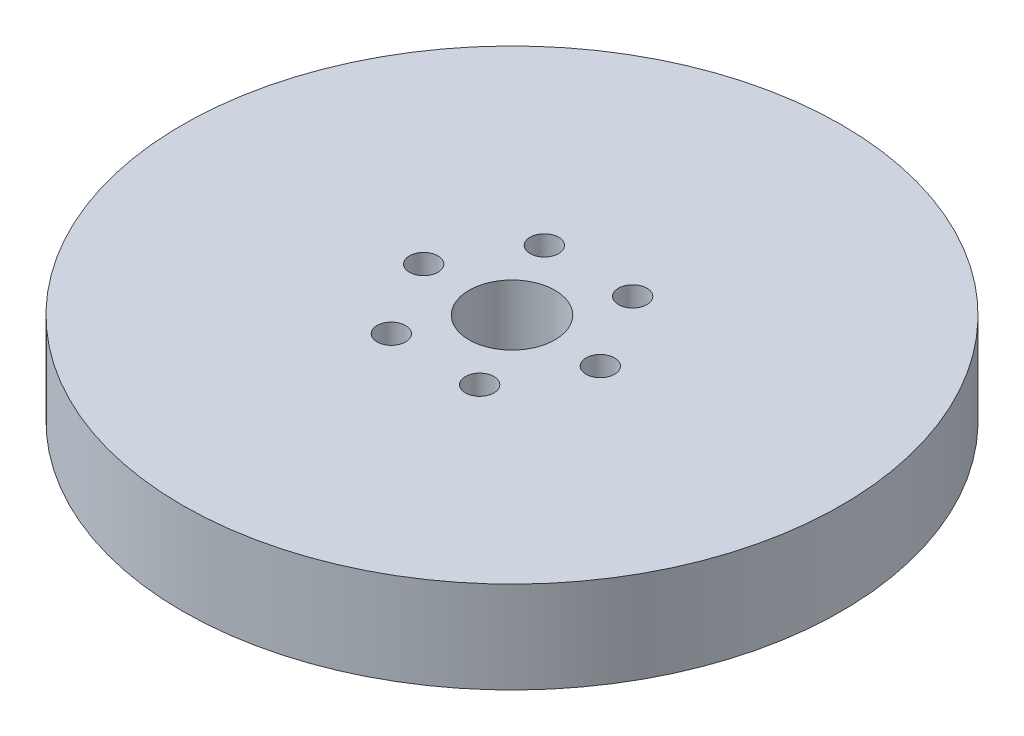
ISO-10303-21;
HEADER;
FILE_DESCRIPTION(('STEP AP214'),'2;1');
FILE_NAME('part.step','',(''),(''),'','','');
FILE_SCHEMA(('AUTOMOTIVE_DESIGN { 1 0 10303 214 1 1 1 1 }'));
ENDSEC;
DATA;
#1=APPLICATION_CONTEXT('core data for automotive mechanical design processes');
#2=APPLICATION_PROTOCOL_DEFINITION('international standard','automotive_design',2000,#1);
#3=PRODUCT_CONTEXT('',#1,'mechanical');
#4=PRODUCT('Part','Part','',(#3));
#5=PRODUCT_RELATED_PRODUCT_CATEGORY('part','',(#4));
#6=PRODUCT_DEFINITION_FORMATION('','',#4);
#7=PRODUCT_DEFINITION_CONTEXT('part definition',#1,'design');
#8=PRODUCT_DEFINITION('design','',#6,#7);
#9=PRODUCT_DEFINITION_SHAPE('','',#8);
#10=(LENGTH_UNIT() NAMED_UNIT(*) SI_UNIT(.MILLI.,.METRE.));
#11=(NAMED_UNIT(*) PLANE_ANGLE_UNIT() SI_UNIT($,.RADIAN.));
#12=(NAMED_UNIT(*) SI_UNIT($,.STERADIAN.) SOLID_ANGLE_UNIT());
#13=UNCERTAINTY_MEASURE_WITH_UNIT(LENGTH_MEASURE(1.E-05),#10,'distance_accuracy_value','');
#14=(GEOMETRIC_REPRESENTATION_CONTEXT(3) GLOBAL_UNCERTAINTY_ASSIGNED_CONTEXT((#13)) GLOBAL_UNIT_ASSIGNED_CONTEXT((#10,
#11,#12)) REPRESENTATION_CONTEXT('',''));
#15=CARTESIAN_POINT('',(0.,0.,0.));
#16=DIRECTION('',(0.,0.,1.));
#17=DIRECTION('',(1.,0.,0.));
#18=AXIS2_PLACEMENT_3D('',#15,#16,#17);
#19=CARTESIAN_POINT('',(0.,16.,0.));
#20=DIRECTION('',(0.,-1.,0.));
#21=DIRECTION('',(0.,0.,-1.));
#22=AXIS2_PLACEMENT_3D('',#19,#20,#21);
#23=CYLINDRICAL_SURFACE('',#22,57.5);
#24=CARTESIAN_POINT('',(0.,16.,0.));
#25=DIRECTION('',(0.,1.,0.));
#26=DIRECTION('',(0.,0.,1.));
#27=AXIS2_PLACEMENT_3D('',#24,#25,#26);
#28=CIRCLE('',#27,57.5);
#29=CARTESIAN_POINT('',(0.,16.,57.5));
#30=VERTEX_POINT('',#29);
#31=EDGE_CURVE('E10',#30,#30,#28,.T.);
#32=ORIENTED_EDGE('',*,*,#31,.F.);
#33=EDGE_LOOP('',(#32));
#34=FACE_BOUND('',#33,.T.);
#35=CARTESIAN_POINT('',(0.,0.,0.));
#36=DIRECTION('',(0.,1.,0.));
#37=DIRECTION('',(0.,0.,1.));
#38=AXIS2_PLACEMENT_3D('',#35,#36,#37);
#39=CIRCLE('',#38,57.5);
#40=CARTESIAN_POINT('',(0.,0.,57.5));
#41=VERTEX_POINT('',#40);
#42=EDGE_CURVE('E37',#41,#41,#39,.T.);
#43=ORIENTED_EDGE('',*,*,#42,.T.);
#44=EDGE_LOOP('',(#43));
#45=FACE_BOUND('',#44,.T.);
#46=ADVANCED_FACE('F40',(#34,#45),#23,.T.);
#47=CARTESIAN_POINT('',(0.,16.,0.));
#48=DIRECTION('',(0.,1.,0.));
#49=DIRECTION('',(0.,0.,1.));
#50=AXIS2_PLACEMENT_3D('',#47,#48,#49);
#51=PLANE('',#50);
#52=CARTESIAN_POINT('',(-7.70600057634373,16.,-13.347184521382));
#53=DIRECTION('',(0.,1.,0.));
#54=DIRECTION('',(-0.866025403784433,0.,0.50000000000001));
#55=AXIS2_PLACEMENT_3D('',#52,#53,#54);
#56=CIRCLE('',#55,2.48706028653939);
#57=CARTESIAN_POINT('',(-9.85985796523024,16.,-12.1036543781123));
#58=VERTEX_POINT('',#57);
#59=EDGE_CURVE('E70',#58,#58,#56,.T.);
#60=ORIENTED_EDGE('',*,*,#59,.F.);
#61=EDGE_LOOP('',(#60));
#62=FACE_BOUND('',#61,.T.);
#63=CARTESIAN_POINT('',(7.70600057634345,16.,-13.3471845213822));
#64=DIRECTION('',(0.,1.,0.));
#65=DIRECTION('',(-0.866025403784443,0.,-0.499999999999992));
#66=AXIS2_PLACEMENT_3D('',#63,#64,#65);
#67=CIRCLE('',#66,2.48706028653939);
#68=CARTESIAN_POINT('',(5.55214318745692,16.,-14.5907146646519));
#69=VERTEX_POINT('',#68);
#70=EDGE_CURVE('E71',#69,#69,#67,.T.);
#71=ORIENTED_EDGE('',*,*,#70,.F.);
#72=EDGE_LOOP('',(#71));
#73=FACE_BOUND('',#72,.T.);
#74=CARTESIAN_POINT('',(15.4120011526872,16.,0.));
#75=DIRECTION('',(0.,1.,0.));
#76=DIRECTION('',(0.,0.,-1.));
#77=AXIS2_PLACEMENT_3D('',#74,#75,#76);
#78=CIRCLE('',#77,2.48706028653939);
#79=CARTESIAN_POINT('',(15.4120011526872,16.,-2.48706028653939));
#80=VERTEX_POINT('',#79);
#81=EDGE_CURVE('E78',#80,#80,#78,.T.);
#82=ORIENTED_EDGE('',*,*,#81,.F.);
#83=EDGE_LOOP('',(#82));
#84=FACE_BOUND('',#83,.T.);
#85=CARTESIAN_POINT('',(7.70600057634364,16.,13.3471845213821));
#86=DIRECTION('',(0.,1.,0.));
#87=DIRECTION('',(0.866025403784436,0.,-0.500000000000004));
#88=AXIS2_PLACEMENT_3D('',#85,#86,#87);
#89=CIRCLE('',#88,2.48706028653939);
#90=CARTESIAN_POINT('',(9.85985796523015,16.,12.1036543781124));
#91=VERTEX_POINT('',#90);
#92=EDGE_CURVE('E84',#91,#91,#89,.T.);
#93=ORIENTED_EDGE('',*,*,#92,.F.);
#94=EDGE_LOOP('',(#93));
#95=FACE_BOUND('',#94,.T.);
#96=CARTESIAN_POINT('',(-7.70600057634355,16.,13.3471845213821));
#97=DIRECTION('',(0.,1.,0.));
#98=DIRECTION('',(0.86602540378444,0.,0.499999999999998));
#99=AXIS2_PLACEMENT_3D('',#96,#97,#98);
#100=CIRCLE('',#99,2.48706028653939);
#101=CARTESIAN_POINT('',(-5.55214318745703,16.,14.5907146646518));
#102=VERTEX_POINT('',#101);
#103=EDGE_CURVE('E61',#102,#102,#100,.T.);
#104=ORIENTED_EDGE('',*,*,#103,.F.);
#105=EDGE_LOOP('',(#104));
#106=FACE_BOUND('',#105,.T.);
#107=CARTESIAN_POINT('',(-15.4120011526872,16.,0.));
#108=DIRECTION('',(0.,1.,0.));
#109=DIRECTION('',(0.,0.,1.));
#110=AXIS2_PLACEMENT_3D('',#107,#108,#109);
#111=CIRCLE('',#110,2.48706028653939);
#112=CARTESIAN_POINT('',(-15.4120011526872,16.,2.48706028653939));
#113=VERTEX_POINT('',#112);
#114=EDGE_CURVE('E54',#113,#113,#111,.T.);
#115=ORIENTED_EDGE('',*,*,#114,.F.);
#116=EDGE_LOOP('',(#115));
#117=FACE_BOUND('',#116,.T.);
#118=CARTESIAN_POINT('',(0.,16.,0.));
#119=DIRECTION('',(0.,1.,0.));
#120=DIRECTION('',(0.,0.,1.));
#121=AXIS2_PLACEMENT_3D('',#118,#119,#120);
#122=CIRCLE('',#121,7.5);
#123=CARTESIAN_POINT('',(0.,16.,7.5));
#124=VERTEX_POINT('',#123);
#125=EDGE_CURVE('E50',#124,#124,#122,.T.);
#126=ORIENTED_EDGE('',*,*,#125,.F.);
#127=EDGE_LOOP('',(#126));
#128=FACE_BOUND('',#127,.T.);
#129=ORIENTED_EDGE('',*,*,#31,.T.);
#130=EDGE_LOOP('',(#129));
#131=FACE_BOUND('',#130,.T.);
#132=ADVANCED_FACE('F99',(#62,#73,#84,#95,#106,#117,#128,#131),#51,.T.);
#133=CARTESIAN_POINT('',(0.,0.,0.));
#134=DIRECTION('',(0.,1.,0.));
#135=DIRECTION('',(0.,0.,1.));
#136=AXIS2_PLACEMENT_3D('',#133,#134,#135);
#137=PLANE('',#136);
#138=CARTESIAN_POINT('',(0.,0.,0.));
#139=DIRECTION('',(0.,1.,0.));
#140=DIRECTION('',(0.,0.,1.));
#141=AXIS2_PLACEMENT_3D('',#138,#139,#140);
#142=CIRCLE('',#141,7.5);
#143=CARTESIAN_POINT('',(0.,0.,7.5));
#144=VERTEX_POINT('',#143);
#145=EDGE_CURVE('E47',#144,#144,#142,.T.);
#146=ORIENTED_EDGE('',*,*,#145,.T.);
#147=EDGE_LOOP('',(#146));
#148=FACE_BOUND('',#147,.T.);
#149=ORIENTED_EDGE('',*,*,#42,.F.);
#150=EDGE_LOOP('',(#149));
#151=FACE_BOUND('',#150,.T.);
#152=ADVANCED_FACE('F103',(#148,#151),#137,.F.);
#153=CARTESIAN_POINT('',(0.,16.,0.));
#154=DIRECTION('',(0.,-1.,0.));
#155=DIRECTION('',(0.,0.,-1.));
#156=AXIS2_PLACEMENT_3D('',#153,#154,#155);
#157=CYLINDRICAL_SURFACE('',#156,7.5);
#158=ORIENTED_EDGE('',*,*,#125,.T.);
#159=EDGE_LOOP('',(#158));
#160=FACE_BOUND('',#159,.T.);
#161=ORIENTED_EDGE('',*,*,#145,.F.);
#162=EDGE_LOOP('',(#161));
#163=FACE_BOUND('',#162,.T.);
#164=ADVANCED_FACE('F115',(#160,#163),#157,.F.);
#165=CARTESIAN_POINT('',(-15.4120011526872,2.23850270558732,0.));
#166=DIRECTION('',(0.,1.,0.));
#167=DIRECTION('',(0.,0.,1.));
#168=AXIS2_PLACEMENT_3D('',#165,#166,#167);
#169=CYLINDRICAL_SURFACE('',#168,2.48706028653939);
#170=CARTESIAN_POINT('',(-15.4120011526872,2.23850270558732,0.));
#171=DIRECTION('',(0.,1.,0.));
#172=DIRECTION('',(0.,0.,1.));
#173=AXIS2_PLACEMENT_3D('',#170,#171,#172);
#174=CIRCLE('',#173,2.48706028653939);
#175=CARTESIAN_POINT('',(-15.4120011526872,2.23850270558732,2.48706028653939));
#176=VERTEX_POINT('',#175);
#177=EDGE_CURVE('E55',#176,#176,#174,.T.);
#178=ORIENTED_EDGE('',*,*,#177,.F.);
#179=EDGE_LOOP('',(#178));
#180=FACE_BOUND('',#179,.T.);
#181=ORIENTED_EDGE('',*,*,#114,.T.);
#182=EDGE_LOOP('',(#181));
#183=FACE_BOUND('',#182,.T.);
#184=ADVANCED_FACE('F113',(#180,#183),#169,.F.);
#185=CARTESIAN_POINT('',(-15.4120011526872,2.23850270558732,0.));
#186=DIRECTION('',(0.,1.,0.));
#187=DIRECTION('',(0.,0.,1.));
#188=AXIS2_PLACEMENT_3D('',#185,#186,#187);
#189=PLANE('',#188);
#190=ORIENTED_EDGE('',*,*,#177,.T.);
#191=EDGE_LOOP('',(#190));
#192=FACE_BOUND('',#191,.T.);
#193=ADVANCED_FACE('F144',(#192),#189,.T.);
#194=CARTESIAN_POINT('',(-7.70600057634355,2.23850270558732,13.3471845213821));
#195=DIRECTION('',(0.,1.,0.));
#196=DIRECTION('',(0.,0.,1.));
#197=AXIS2_PLACEMENT_3D('',#194,#195,#196);
#198=CYLINDRICAL_SURFACE('',#197,2.48706028653939);
#199=CARTESIAN_POINT('',(-7.70600057634355,2.23850270558732,13.3471845213821));
#200=DIRECTION('',(0.,1.,0.));
#201=DIRECTION('',(0.86602540378444,0.,0.499999999999998));
#202=AXIS2_PLACEMENT_3D('',#199,#200,#201);
#203=CIRCLE('',#202,2.48706028653939);
#204=CARTESIAN_POINT('',(-5.55214318745703,2.23850270558732,14.5907146646518));
#205=VERTEX_POINT('',#204);
#206=EDGE_CURVE('E59',#205,#205,#203,.T.);
#207=ORIENTED_EDGE('',*,*,#206,.F.);
#208=EDGE_LOOP('',(#207));
#209=FACE_BOUND('',#208,.T.);
#210=ORIENTED_EDGE('',*,*,#103,.T.);
#211=EDGE_LOOP('',(#210));
#212=FACE_BOUND('',#211,.T.);
#213=ADVANCED_FACE('F153',(#209,#212),#198,.F.);
#214=CARTESIAN_POINT('',(-7.70600057634355,2.23850270558732,13.3471845213821));
#215=DIRECTION('',(0.,1.,0.));
#216=DIRECTION('',(0.86602540378444,0.,0.499999999999998));
#217=AXIS2_PLACEMENT_3D('',#214,#215,#216);
#218=PLANE('',#217);
#219=ORIENTED_EDGE('',*,*,#206,.T.);
#220=EDGE_LOOP('',(#219));
#221=FACE_BOUND('',#220,.T.);
#222=ADVANCED_FACE('F96',(#221),#218,.T.);
#223=CARTESIAN_POINT('',(7.70600057634364,2.23850270558732,13.3471845213821));
#224=DIRECTION('',(0.,1.,0.));
#225=DIRECTION('',(0.,0.,1.));
#226=AXIS2_PLACEMENT_3D('',#223,#224,#225);
#227=CYLINDRICAL_SURFACE('',#226,2.48706028653939);
#228=CARTESIAN_POINT('',(7.70600057634364,2.23850270558732,13.3471845213821));
#229=DIRECTION('',(0.,1.,0.));
#230=DIRECTION('',(0.866025403784436,0.,-0.500000000000004));
#231=AXIS2_PLACEMENT_3D('',#228,#229,#230);
#232=CIRCLE('',#231,2.48706028653939);
#233=CARTESIAN_POINT('',(9.85985796523015,2.23850270558732,12.1036543781124));
#234=VERTEX_POINT('',#233);
#235=EDGE_CURVE('E63',#234,#234,#232,.T.);
#236=ORIENTED_EDGE('',*,*,#235,.F.);
#237=EDGE_LOOP('',(#236));
#238=FACE_BOUND('',#237,.T.);
#239=ORIENTED_EDGE('',*,*,#92,.T.);
#240=EDGE_LOOP('',(#239));
#241=FACE_BOUND('',#240,.T.);
#242=ADVANCED_FACE('F91',(#238,#241),#227,.F.);
#243=CARTESIAN_POINT('',(7.70600057634364,2.23850270558732,13.3471845213821));
#244=DIRECTION('',(0.,1.,0.));
#245=DIRECTION('',(0.866025403784436,0.,-0.500000000000004));
#246=AXIS2_PLACEMENT_3D('',#243,#244,#245);
#247=PLANE('',#246);
#248=ORIENTED_EDGE('',*,*,#235,.T.);
#249=EDGE_LOOP('',(#248));
#250=FACE_BOUND('',#249,.T.);
#251=ADVANCED_FACE('F93',(#250),#247,.T.);
#252=CARTESIAN_POINT('',(15.4120011526872,2.23850270558732,0.));
#253=DIRECTION('',(0.,1.,0.));
#254=DIRECTION('',(0.,0.,1.));
#255=AXIS2_PLACEMENT_3D('',#252,#253,#254);
#256=CYLINDRICAL_SURFACE('',#255,2.48706028653939);
#257=CARTESIAN_POINT('',(15.4120011526872,2.23850270558732,0.));
#258=DIRECTION('',(0.,1.,0.));
#259=DIRECTION('',(0.,0.,-1.));
#260=AXIS2_PLACEMENT_3D('',#257,#258,#259);
#261=CIRCLE('',#260,2.48706028653939);
#262=CARTESIAN_POINT('',(15.4120011526872,2.23850270558732,-2.48706028653939));
#263=VERTEX_POINT('',#262);
#264=EDGE_CURVE('E85',#263,#263,#261,.T.);
#265=ORIENTED_EDGE('',*,*,#264,.F.);
#266=EDGE_LOOP('',(#265));
#267=FACE_BOUND('',#266,.T.);
#268=ORIENTED_EDGE('',*,*,#81,.T.);
#269=EDGE_LOOP('',(#268));
#270=FACE_BOUND('',#269,.T.);
#271=ADVANCED_FACE('F187',(#267,#270),#256,.F.);
#272=CARTESIAN_POINT('',(15.4120011526872,2.23850270558732,0.));
#273=DIRECTION('',(0.,1.,0.));
#274=DIRECTION('',(0.,0.,-1.));
#275=AXIS2_PLACEMENT_3D('',#272,#273,#274);
#276=PLANE('',#275);
#277=ORIENTED_EDGE('',*,*,#264,.T.);
#278=EDGE_LOOP('',(#277));
#279=FACE_BOUND('',#278,.T.);
#280=ADVANCED_FACE('F198',(#279),#276,.T.);
#281=CARTESIAN_POINT('',(7.70600057634345,2.23850270558732,-13.3471845213822));
#282=DIRECTION('',(0.,1.,0.));
#283=DIRECTION('',(0.,0.,1.));
#284=AXIS2_PLACEMENT_3D('',#281,#282,#283);
#285=CYLINDRICAL_SURFACE('',#284,2.48706028653939);
#286=CARTESIAN_POINT('',(7.70600057634345,2.23850270558732,-13.3471845213822));
#287=DIRECTION('',(0.,1.,0.));
#288=DIRECTION('',(-0.866025403784443,0.,-0.499999999999992));
#289=AXIS2_PLACEMENT_3D('',#286,#287,#288);
#290=CIRCLE('',#289,2.48706028653939);
#291=CARTESIAN_POINT('',(5.55214318745692,2.23850270558732,-14.5907146646519));
#292=VERTEX_POINT('',#291);
#293=EDGE_CURVE('E76',#292,#292,#290,.T.);
#294=ORIENTED_EDGE('',*,*,#293,.F.);
#295=EDGE_LOOP('',(#294));
#296=FACE_BOUND('',#295,.T.);
#297=ORIENTED_EDGE('',*,*,#70,.T.);
#298=EDGE_LOOP('',(#297));
#299=FACE_BOUND('',#298,.T.);
#300=ADVANCED_FACE('F202',(#296,#299),#285,.F.);
#301=CARTESIAN_POINT('',(7.70600057634345,2.23850270558732,-13.3471845213822));
#302=DIRECTION('',(0.,1.,0.));
#303=DIRECTION('',(-0.866025403784443,0.,-0.499999999999992));
#304=AXIS2_PLACEMENT_3D('',#301,#302,#303);
#305=PLANE('',#304);
#306=ORIENTED_EDGE('',*,*,#293,.T.);
#307=EDGE_LOOP('',(#306));
#308=FACE_BOUND('',#307,.T.);
#309=ADVANCED_FACE('F212',(#308),#305,.T.);
#310=CARTESIAN_POINT('',(-7.70600057634373,2.23850270558732,-13.347184521382));
#311=DIRECTION('',(0.,1.,0.));
#312=DIRECTION('',(0.,0.,1.));
#313=AXIS2_PLACEMENT_3D('',#310,#311,#312);
#314=CYLINDRICAL_SURFACE('',#313,2.48706028653939);
#315=CARTESIAN_POINT('',(-7.70600057634373,2.23850270558732,-13.347184521382));
#316=DIRECTION('',(0.,1.,0.));
#317=DIRECTION('',(-0.866025403784433,0.,0.50000000000001));
#318=AXIS2_PLACEMENT_3D('',#315,#316,#317);
#319=CIRCLE('',#318,2.48706028653939);
#320=CARTESIAN_POINT('',(-9.85985796523024,2.23850270558732,-12.1036543781123));
#321=VERTEX_POINT('',#320);
#322=EDGE_CURVE('E69',#321,#321,#319,.T.);
#323=ORIENTED_EDGE('',*,*,#322,.F.);
#324=EDGE_LOOP('',(#323));
#325=FACE_BOUND('',#324,.T.);
#326=ORIENTED_EDGE('',*,*,#59,.T.);
#327=EDGE_LOOP('',(#326));
#328=FACE_BOUND('',#327,.T.);
#329=ADVANCED_FACE('F224',(#325,#328),#314,.F.);
#330=CARTESIAN_POINT('',(-7.70600057634373,2.23850270558732,-13.347184521382));
#331=DIRECTION('',(0.,1.,0.));
#332=DIRECTION('',(-0.866025403784433,0.,0.50000000000001));
#333=AXIS2_PLACEMENT_3D('',#330,#331,#332);
#334=PLANE('',#333);
#335=ORIENTED_EDGE('',*,*,#322,.T.);
#336=EDGE_LOOP('',(#335));
#337=FACE_BOUND('',#336,.T.);
#338=ADVANCED_FACE('F235',(#337),#334,.T.);
#339=CLOSED_SHELL('',(#46,#132,#152,#164,#184,#193,#213,#222,#242,#251,#271,#280,#300,#309,#329,#338));
#340=MANIFOLD_SOLID_BREP('B2',#339);
#341=ADVANCED_BREP_SHAPE_REPRESENTATION('',(#18,#340),#14);
#342=SHAPE_DEFINITION_REPRESENTATION(#9,#341);
ENDSEC;
END-ISO-10303-21;
